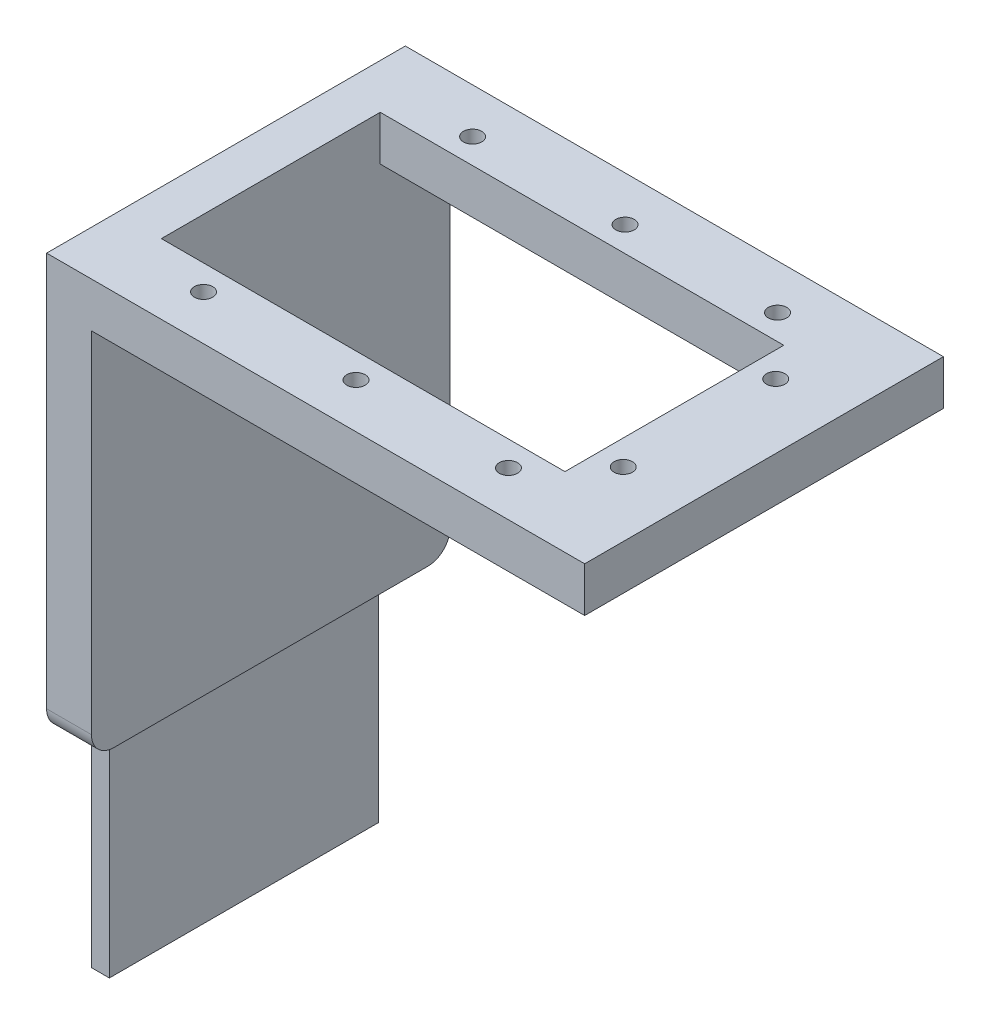
ISO-10303-21;
HEADER;
FILE_DESCRIPTION(('STEP AP214'),'2;1');
FILE_NAME('part.step','',(''),(''),'','','');
FILE_SCHEMA(('AUTOMOTIVE_DESIGN { 1 0 10303 214 1 1 1 1 }'));
ENDSEC;
DATA;
#1=APPLICATION_CONTEXT('core data for automotive mechanical design processes');
#2=APPLICATION_PROTOCOL_DEFINITION('international standard','automotive_design',2000,#1);
#3=PRODUCT_CONTEXT('',#1,'mechanical');
#4=PRODUCT('Part','Part','',(#3));
#5=PRODUCT_RELATED_PRODUCT_CATEGORY('part','',(#4));
#6=PRODUCT_DEFINITION_FORMATION('','',#4);
#7=PRODUCT_DEFINITION_CONTEXT('part definition',#1,'design');
#8=PRODUCT_DEFINITION('design','',#6,#7);
#9=PRODUCT_DEFINITION_SHAPE('','',#8);
#10=(LENGTH_UNIT() NAMED_UNIT(*) SI_UNIT(.MILLI.,.METRE.));
#11=(NAMED_UNIT(*) PLANE_ANGLE_UNIT() SI_UNIT($,.RADIAN.));
#12=(NAMED_UNIT(*) SI_UNIT($,.STERADIAN.) SOLID_ANGLE_UNIT());
#13=UNCERTAINTY_MEASURE_WITH_UNIT(LENGTH_MEASURE(1.E-05),#10,'distance_accuracy_value','');
#14=(GEOMETRIC_REPRESENTATION_CONTEXT(3) GLOBAL_UNCERTAINTY_ASSIGNED_CONTEXT((#13)) GLOBAL_UNIT_ASSIGNED_CONTEXT((#10,
#11,#12)) REPRESENTATION_CONTEXT('',''));
#15=CARTESIAN_POINT('',(0.,0.,0.));
#16=DIRECTION('',(0.,0.,1.));
#17=DIRECTION('',(1.,0.,0.));
#18=AXIS2_PLACEMENT_3D('',#15,#16,#17);
#19=CARTESIAN_POINT('',(0.,-41.5,0.));
#20=DIRECTION('',(0.,1.,0.));
#21=DIRECTION('',(0.,0.,1.));
#22=AXIS2_PLACEMENT_3D('',#19,#20,#21);
#23=PLANE('',#22);
#24=DIRECTION('',(-1.,0.,0.));
#25=VECTOR('',#24,1.);
#26=CARTESIAN_POINT('',(0.,-41.5,-2.5));
#27=LINE('',#26,#25);
#28=CARTESIAN_POINT('',(5.,-41.5,-2.5));
#29=VERTEX_POINT('',#28);
#30=CARTESIAN_POINT('',(4.50000000000001,-41.5,-2.5));
#31=VERTEX_POINT('',#30);
#32=EDGE_CURVE('E265',#29,#31,#27,.T.);
#33=ORIENTED_EDGE('',*,*,#32,.T.);
#34=DIRECTION('',(0.,0.,1.));
#35=VECTOR('',#34,1.);
#36=CARTESIAN_POINT('',(4.50000000000001,-41.5,-35.));
#37=LINE('',#36,#35);
#38=CARTESIAN_POINT('',(4.50000000000001,-41.5,-37.5));
#39=VERTEX_POINT('',#38);
#40=EDGE_CURVE('E259',#31,#39,#37,.F.);
#41=ORIENTED_EDGE('',*,*,#40,.T.);
#42=DIRECTION('',(1.,0.,0.));
#43=VECTOR('',#42,1.);
#44=CARTESIAN_POINT('',(0.,-41.5,-37.5));
#45=LINE('',#44,#43);
#46=CARTESIAN_POINT('',(5.,-41.5,-37.5));
#47=VERTEX_POINT('',#46);
#48=EDGE_CURVE('E263',#39,#47,#45,.T.);
#49=ORIENTED_EDGE('',*,*,#48,.T.);
#50=DIRECTION('',(0.,0.,1.));
#51=VECTOR('',#50,1.);
#52=CARTESIAN_POINT('',(5.,-41.5,-40.));
#53=LINE('',#52,#51);
#54=EDGE_CURVE('E191',#47,#29,#53,.T.);
#55=ORIENTED_EDGE('',*,*,#54,.T.);
#56=EDGE_LOOP('',(#33,#41,#49,#55));
#57=FACE_BOUND('',#56,.T.);
#58=ADVANCED_FACE('F39',(#57),#23,.F.);
#59=CARTESIAN_POINT('',(0.,5.,0.));
#60=DIRECTION('',(0.,-1.,0.));
#61=DIRECTION('',(0.,0.,-1.));
#62=AXIS2_PLACEMENT_3D('',#59,#60,#61);
#63=PLANE('',#62);
#64=CARTESIAN_POINT('',(29.5000000000001,5.,-5.00000000000046));
#65=DIRECTION('',(0.,-1.,0.));
#66=DIRECTION('',(0.,0.,-1.));
#67=AXIS2_PLACEMENT_3D('',#64,#65,#66);
#68=CIRCLE('',#67,1.025);
#69=CARTESIAN_POINT('',(29.5000000000001,5.,-6.02500000000046));
#70=VERTEX_POINT('',#69);
#71=EDGE_CURVE('E301',#70,#70,#68,.F.);
#72=ORIENTED_EDGE('',*,*,#71,.F.);
#73=EDGE_LOOP('',(#72));
#74=FACE_BOUND('',#73,.T.);
#75=CARTESIAN_POINT('',(12.5000000000001,5.,-5.00000000000046));
#76=DIRECTION('',(0.,-1.,0.));
#77=DIRECTION('',(0.,0.,-1.));
#78=AXIS2_PLACEMENT_3D('',#75,#76,#77);
#79=CIRCLE('',#78,1.025);
#80=CARTESIAN_POINT('',(12.5000000000001,5.,-6.02500000000046));
#81=VERTEX_POINT('',#80);
#82=EDGE_CURVE('E616',#81,#81,#79,.F.);
#83=ORIENTED_EDGE('',*,*,#82,.F.);
#84=EDGE_LOOP('',(#83));
#85=FACE_BOUND('',#84,.T.);
#86=CARTESIAN_POINT('',(52.8000000000001,5.,-11.5000000000005));
#87=DIRECTION('',(0.,-1.,0.));
#88=DIRECTION('',(0.,0.,-1.));
#89=AXIS2_PLACEMENT_3D('',#86,#87,#88);
#90=CIRCLE('',#89,1.025);
#91=CARTESIAN_POINT('',(52.8000000000001,5.,-12.5250000000005));
#92=VERTEX_POINT('',#91);
#93=EDGE_CURVE('E621',#92,#92,#90,.F.);
#94=ORIENTED_EDGE('',*,*,#93,.F.);
#95=EDGE_LOOP('',(#94));
#96=FACE_BOUND('',#95,.T.);
#97=CARTESIAN_POINT('',(12.5000000000001,5.,-34.9999999999993));
#98=DIRECTION('',(0.,-1.,0.));
#99=DIRECTION('',(0.,0.,-1.));
#100=AXIS2_PLACEMENT_3D('',#97,#98,#99);
#101=CIRCLE('',#100,1.025);
#102=CARTESIAN_POINT('',(12.5000000000001,5.,-36.0249999999993));
#103=VERTEX_POINT('',#102);
#104=EDGE_CURVE('E625',#103,#103,#101,.F.);
#105=ORIENTED_EDGE('',*,*,#104,.F.);
#106=EDGE_LOOP('',(#105));
#107=FACE_BOUND('',#106,.T.);
#108=CARTESIAN_POINT('',(29.5000000000001,5.,-34.9999999999993));
#109=DIRECTION('',(0.,-1.,0.));
#110=DIRECTION('',(0.,0.,-1.));
#111=AXIS2_PLACEMENT_3D('',#108,#109,#110);
#112=CIRCLE('',#111,1.025);
#113=CARTESIAN_POINT('',(29.5000000000001,5.,-36.0249999999993));
#114=VERTEX_POINT('',#113);
#115=EDGE_CURVE('E628',#114,#114,#112,.F.);
#116=ORIENTED_EDGE('',*,*,#115,.F.);
#117=EDGE_LOOP('',(#116));
#118=FACE_BOUND('',#117,.T.);
#119=CARTESIAN_POINT('',(46.5000000000001,5.,-34.9999999999993));
#120=DIRECTION('',(0.,-1.,0.));
#121=DIRECTION('',(0.,0.,-1.));
#122=AXIS2_PLACEMENT_3D('',#119,#120,#121);
#123=CIRCLE('',#122,1.025);
#124=CARTESIAN_POINT('',(46.5000000000001,5.,-36.0249999999993));
#125=VERTEX_POINT('',#124);
#126=EDGE_CURVE('E640',#125,#125,#123,.F.);
#127=ORIENTED_EDGE('',*,*,#126,.F.);
#128=EDGE_LOOP('',(#127));
#129=FACE_BOUND('',#128,.T.);
#130=CARTESIAN_POINT('',(52.8000000000001,5.,-28.4999999999993));
#131=DIRECTION('',(0.,-1.,0.));
#132=DIRECTION('',(0.,0.,-1.));
#133=AXIS2_PLACEMENT_3D('',#130,#131,#132);
#134=CIRCLE('',#133,1.025);
#135=CARTESIAN_POINT('',(52.8000000000001,5.,-29.5249999999993));
#136=VERTEX_POINT('',#135);
#137=EDGE_CURVE('E644',#136,#136,#134,.F.);
#138=ORIENTED_EDGE('',*,*,#137,.F.);
#139=EDGE_LOOP('',(#138));
#140=FACE_BOUND('',#139,.T.);
#141=CARTESIAN_POINT('',(46.5000000000001,5.,-5.00000000000046));
#142=DIRECTION('',(0.,-1.,0.));
#143=DIRECTION('',(0.,0.,-1.));
#144=AXIS2_PLACEMENT_3D('',#141,#142,#143);
#145=CIRCLE('',#144,1.025);
#146=CARTESIAN_POINT('',(46.5000000000001,5.,-6.02500000000045));
#147=VERTEX_POINT('',#146);
#148=EDGE_CURVE('E291',#147,#147,#145,.F.);
#149=ORIENTED_EDGE('',*,*,#148,.F.);
#150=EDGE_LOOP('',(#149));
#151=FACE_BOUND('',#150,.T.);
#152=DIRECTION('',(0.,0.,1.));
#153=VECTOR('',#152,1.);
#154=CARTESIAN_POINT('',(0.,5.,0.));
#155=LINE('',#154,#153);
#156=CARTESIAN_POINT('',(0.,5.,-40.));
#157=VERTEX_POINT('',#156);
#158=CARTESIAN_POINT('',(0.,5.,0.));
#159=VERTEX_POINT('',#158);
#160=EDGE_CURVE('E232',#157,#159,#155,.T.);
#161=ORIENTED_EDGE('',*,*,#160,.T.);
#162=DIRECTION('',(1.,0.,0.));
#163=VECTOR('',#162,1.);
#164=CARTESIAN_POINT('',(0.,5.,0.));
#165=LINE('',#164,#163);
#166=CARTESIAN_POINT('',(60.,5.,0.));
#167=VERTEX_POINT('',#166);
#168=EDGE_CURVE('E235',#159,#167,#165,.T.);
#169=ORIENTED_EDGE('',*,*,#168,.T.);
#170=DIRECTION('',(0.,0.,-1.));
#171=VECTOR('',#170,1.);
#172=CARTESIAN_POINT('',(60.,5.,0.));
#173=LINE('',#172,#171);
#174=CARTESIAN_POINT('',(60.,5.,-40.));
#175=VERTEX_POINT('',#174);
#176=EDGE_CURVE('E238',#167,#175,#173,.T.);
#177=ORIENTED_EDGE('',*,*,#176,.T.);
#178=DIRECTION('',(-1.,0.,0.));
#179=VECTOR('',#178,1.);
#180=CARTESIAN_POINT('',(0.,5.,-40.));
#181=LINE('',#180,#179);
#182=EDGE_CURVE('E240',#175,#157,#181,.T.);
#183=ORIENTED_EDGE('',*,*,#182,.T.);
#184=EDGE_LOOP('',(#161,#169,#177,#183));
#185=FACE_BOUND('',#184,.T.);
#186=DIRECTION('',(0.,0.,1.));
#187=VECTOR('',#186,1.);
#188=CARTESIAN_POINT('',(5.,5.,-7.8));
#189=LINE('',#188,#187);
#190=CARTESIAN_POINT('',(5.,5.,-32.2));
#191=VERTEX_POINT('',#190);
#192=CARTESIAN_POINT('',(5.,5.,-7.8));
#193=VERTEX_POINT('',#192);
#194=EDGE_CURVE('E205',#191,#193,#189,.T.);
#195=ORIENTED_EDGE('',*,*,#194,.F.);
#196=DIRECTION('',(-1.,0.,0.));
#197=VECTOR('',#196,1.);
#198=CARTESIAN_POINT('',(5.,5.,-32.2));
#199=LINE('',#198,#197);
#200=CARTESIAN_POINT('',(50.,5.,-32.2));
#201=VERTEX_POINT('',#200);
#202=EDGE_CURVE('E213',#201,#191,#199,.T.);
#203=ORIENTED_EDGE('',*,*,#202,.F.);
#204=DIRECTION('',(0.,0.,-1.));
#205=VECTOR('',#204,1.);
#206=CARTESIAN_POINT('',(50.,5.,-7.8));
#207=LINE('',#206,#205);
#208=CARTESIAN_POINT('',(50.,5.,-7.8));
#209=VERTEX_POINT('',#208);
#210=EDGE_CURVE('E210',#209,#201,#207,.T.);
#211=ORIENTED_EDGE('',*,*,#210,.F.);
#212=DIRECTION('',(1.,0.,0.));
#213=VECTOR('',#212,1.);
#214=CARTESIAN_POINT('',(5.,5.,-7.8));
#215=LINE('',#214,#213);
#216=EDGE_CURVE('E207',#193,#209,#215,.T.);
#217=ORIENTED_EDGE('',*,*,#216,.F.);
#218=EDGE_LOOP('',(#195,#203,#211,#217));
#219=FACE_BOUND('',#218,.T.);
#220=ADVANCED_FACE('F337',(#74,#85,#96,#107,#118,#129,#140,#151,#185,#219),#63,.F.);
#221=CARTESIAN_POINT('',(0.,0.,0.));
#222=DIRECTION('',(0.,-1.,0.));
#223=DIRECTION('',(0.,0.,-1.));
#224=AXIS2_PLACEMENT_3D('',#221,#222,#223);
#225=PLANE('',#224);
#226=CARTESIAN_POINT('',(29.5000000000001,0.,-5.00000000000046));
#227=DIRECTION('',(0.,-1.,0.));
#228=DIRECTION('',(0.,0.,-1.));
#229=AXIS2_PLACEMENT_3D('',#226,#227,#228);
#230=CIRCLE('',#229,1.025);
#231=CARTESIAN_POINT('',(29.5000000000001,0.,-6.02500000000046));
#232=VERTEX_POINT('',#231);
#233=EDGE_CURVE('E403',#232,#232,#230,.T.);
#234=ORIENTED_EDGE('',*,*,#233,.F.);
#235=EDGE_LOOP('',(#234));
#236=FACE_BOUND('',#235,.T.);
#237=CARTESIAN_POINT('',(12.5000000000001,0.,-5.00000000000046));
#238=DIRECTION('',(0.,-1.,0.));
#239=DIRECTION('',(0.,0.,-1.));
#240=AXIS2_PLACEMENT_3D('',#237,#238,#239);
#241=CIRCLE('',#240,1.025);
#242=CARTESIAN_POINT('',(12.5000000000001,0.,-6.02500000000046));
#243=VERTEX_POINT('',#242);
#244=EDGE_CURVE('E407',#243,#243,#241,.T.);
#245=ORIENTED_EDGE('',*,*,#244,.F.);
#246=EDGE_LOOP('',(#245));
#247=FACE_BOUND('',#246,.T.);
#248=CARTESIAN_POINT('',(52.8000000000001,0.,-11.5000000000005));
#249=DIRECTION('',(0.,-1.,0.));
#250=DIRECTION('',(0.,0.,-1.));
#251=AXIS2_PLACEMENT_3D('',#248,#249,#250);
#252=CIRCLE('',#251,1.025);
#253=CARTESIAN_POINT('',(52.8000000000001,0.,-12.5250000000005));
#254=VERTEX_POINT('',#253);
#255=EDGE_CURVE('E411',#254,#254,#252,.T.);
#256=ORIENTED_EDGE('',*,*,#255,.F.);
#257=EDGE_LOOP('',(#256));
#258=FACE_BOUND('',#257,.T.);
#259=CARTESIAN_POINT('',(12.5000000000001,0.,-34.9999999999993));
#260=DIRECTION('',(0.,-1.,0.));
#261=DIRECTION('',(0.,0.,1.));
#262=AXIS2_PLACEMENT_3D('',#259,#260,#261);
#263=CIRCLE('',#262,1.025);
#264=CARTESIAN_POINT('',(12.5000000000001,0.,-33.9749999999993));
#265=VERTEX_POINT('',#264);
#266=EDGE_CURVE('E415',#265,#265,#263,.T.);
#267=ORIENTED_EDGE('',*,*,#266,.F.);
#268=EDGE_LOOP('',(#267));
#269=FACE_BOUND('',#268,.T.);
#270=CARTESIAN_POINT('',(29.5000000000001,0.,-34.9999999999993));
#271=DIRECTION('',(0.,-1.,0.));
#272=DIRECTION('',(0.,0.,1.));
#273=AXIS2_PLACEMENT_3D('',#270,#271,#272);
#274=CIRCLE('',#273,1.025);
#275=CARTESIAN_POINT('',(29.5000000000001,0.,-33.9749999999993));
#276=VERTEX_POINT('',#275);
#277=EDGE_CURVE('E419',#276,#276,#274,.T.);
#278=ORIENTED_EDGE('',*,*,#277,.F.);
#279=EDGE_LOOP('',(#278));
#280=FACE_BOUND('',#279,.T.);
#281=CARTESIAN_POINT('',(46.5000000000001,0.,-34.9999999999993));
#282=DIRECTION('',(0.,-1.,0.));
#283=DIRECTION('',(0.,0.,1.));
#284=AXIS2_PLACEMENT_3D('',#281,#282,#283);
#285=CIRCLE('',#284,1.025);
#286=CARTESIAN_POINT('',(46.5000000000001,0.,-33.9749999999993));
#287=VERTEX_POINT('',#286);
#288=EDGE_CURVE('E423',#287,#287,#285,.T.);
#289=ORIENTED_EDGE('',*,*,#288,.F.);
#290=EDGE_LOOP('',(#289));
#291=FACE_BOUND('',#290,.T.);
#292=CARTESIAN_POINT('',(52.8000000000001,0.,-28.4999999999993));
#293=DIRECTION('',(0.,-1.,0.));
#294=DIRECTION('',(0.,0.,1.));
#295=AXIS2_PLACEMENT_3D('',#292,#293,#294);
#296=CIRCLE('',#295,1.025);
#297=CARTESIAN_POINT('',(52.8000000000001,0.,-27.4749999999993));
#298=VERTEX_POINT('',#297);
#299=EDGE_CURVE('E427',#298,#298,#296,.T.);
#300=ORIENTED_EDGE('',*,*,#299,.F.);
#301=EDGE_LOOP('',(#300));
#302=FACE_BOUND('',#301,.T.);
#303=CARTESIAN_POINT('',(46.5000000000001,0.,-5.00000000000046));
#304=DIRECTION('',(0.,-1.,0.));
#305=DIRECTION('',(0.,0.,-1.));
#306=AXIS2_PLACEMENT_3D('',#303,#304,#305);
#307=CIRCLE('',#306,1.025);
#308=CARTESIAN_POINT('',(46.5000000000001,0.,-6.02500000000045));
#309=VERTEX_POINT('',#308);
#310=EDGE_CURVE('E296',#309,#309,#307,.T.);
#311=ORIENTED_EDGE('',*,*,#310,.F.);
#312=EDGE_LOOP('',(#311));
#313=FACE_BOUND('',#312,.T.);
#314=DIRECTION('',(0.,0.,1.));
#315=VECTOR('',#314,1.);
#316=CARTESIAN_POINT('',(5.,0.,-40.));
#317=LINE('',#316,#315);
#318=CARTESIAN_POINT('',(5.,0.,-40.));
#319=VERTEX_POINT('',#318);
#320=CARTESIAN_POINT('',(5.,0.,-32.2));
#321=VERTEX_POINT('',#320);
#322=EDGE_CURVE('E188',#319,#321,#317,.T.);
#323=ORIENTED_EDGE('',*,*,#322,.F.);
#324=DIRECTION('',(-1.,0.,0.));
#325=VECTOR('',#324,1.);
#326=CARTESIAN_POINT('',(0.,0.,-40.));
#327=LINE('',#326,#325);
#328=CARTESIAN_POINT('',(60.,0.,-40.));
#329=VERTEX_POINT('',#328);
#330=EDGE_CURVE('E236',#329,#319,#327,.T.);
#331=ORIENTED_EDGE('',*,*,#330,.F.);
#332=DIRECTION('',(0.,0.,-1.));
#333=VECTOR('',#332,1.);
#334=CARTESIAN_POINT('',(60.,0.,0.));
#335=LINE('',#334,#333);
#336=CARTESIAN_POINT('',(60.,0.,0.));
#337=VERTEX_POINT('',#336);
#338=EDGE_CURVE('E244',#337,#329,#335,.T.);
#339=ORIENTED_EDGE('',*,*,#338,.F.);
#340=DIRECTION('',(1.,0.,0.));
#341=VECTOR('',#340,1.);
#342=CARTESIAN_POINT('',(0.,0.,0.));
#343=LINE('',#342,#341);
#344=CARTESIAN_POINT('',(5.,0.,0.));
#345=VERTEX_POINT('',#344);
#346=EDGE_CURVE('E231',#345,#337,#343,.T.);
#347=ORIENTED_EDGE('',*,*,#346,.F.);
#348=CARTESIAN_POINT('',(5.,0.,-7.8));
#349=VERTEX_POINT('',#348);
#350=EDGE_CURVE('E193',#349,#345,#317,.T.);
#351=ORIENTED_EDGE('',*,*,#350,.F.);
#352=DIRECTION('',(1.,0.,0.));
#353=VECTOR('',#352,1.);
#354=CARTESIAN_POINT('',(5.,0.,-7.8));
#355=LINE('',#354,#353);
#356=CARTESIAN_POINT('',(50.,0.,-7.8));
#357=VERTEX_POINT('',#356);
#358=EDGE_CURVE('E204',#349,#357,#355,.T.);
#359=ORIENTED_EDGE('',*,*,#358,.T.);
#360=DIRECTION('',(0.,0.,-1.));
#361=VECTOR('',#360,1.);
#362=CARTESIAN_POINT('',(50.,0.,-7.8));
#363=LINE('',#362,#361);
#364=CARTESIAN_POINT('',(50.,0.,-32.2));
#365=VERTEX_POINT('',#364);
#366=EDGE_CURVE('E218',#357,#365,#363,.T.);
#367=ORIENTED_EDGE('',*,*,#366,.T.);
#368=DIRECTION('',(-1.,0.,0.));
#369=VECTOR('',#368,1.);
#370=CARTESIAN_POINT('',(5.,0.,-32.2));
#371=LINE('',#370,#369);
#372=EDGE_CURVE('E208',#365,#321,#371,.T.);
#373=ORIENTED_EDGE('',*,*,#372,.T.);
#374=EDGE_LOOP('',(#323,#331,#339,#347,#351,#359,#367,#373));
#375=FACE_BOUND('',#374,.T.);
#376=ADVANCED_FACE('F347',(#236,#247,#258,#269,#280,#291,#302,#313,#375),#225,.T.);
#377=CARTESIAN_POINT('',(0.,5.,0.));
#378=DIRECTION('',(1.,0.,0.));
#379=DIRECTION('',(0.,0.,-1.));
#380=AXIS2_PLACEMENT_3D('',#377,#378,#379);
#381=PLANE('',#380);
#382=DIRECTION('',(0.,1.,0.));
#383=VECTOR('',#382,1.);
#384=CARTESIAN_POINT('',(0.,-66.5,-5.));
#385=LINE('',#384,#383);
#386=CARTESIAN_POINT('',(0.,-66.5,-5.));
#387=VERTEX_POINT('',#386);
#388=CARTESIAN_POINT('',(0.,-44.,-5.));
#389=VERTEX_POINT('',#388);
#390=EDGE_CURVE('E169',#387,#389,#385,.T.);
#391=ORIENTED_EDGE('',*,*,#390,.T.);
#392=CARTESIAN_POINT('',(0.,-44.,-2.5));
#393=DIRECTION('',(1.,0.,0.));
#394=DIRECTION('',(0.,0.,-1.));
#395=AXIS2_PLACEMENT_3D('',#392,#393,#394);
#396=CIRCLE('',#395,2.5);
#397=CARTESIAN_POINT('',(0.,-41.5,-2.5));
#398=VERTEX_POINT('',#397);
#399=EDGE_CURVE('E281',#389,#398,#396,.T.);
#400=ORIENTED_EDGE('',*,*,#399,.T.);
#401=CARTESIAN_POINT('',(0.,-39.,-2.5));
#402=DIRECTION('',(1.,0.,0.));
#403=DIRECTION('',(0.,0.,-1.));
#404=AXIS2_PLACEMENT_3D('',#401,#402,#403);
#405=CIRCLE('',#404,2.5);
#406=CARTESIAN_POINT('',(0.,-39.,0.));
#407=VERTEX_POINT('',#406);
#408=EDGE_CURVE('E273',#398,#407,#405,.F.);
#409=ORIENTED_EDGE('',*,*,#408,.T.);
#410=DIRECTION('',(0.,-1.,0.));
#411=VECTOR('',#410,1.);
#412=CARTESIAN_POINT('',(0.,5.,0.));
#413=LINE('',#412,#411);
#414=EDGE_CURVE('E256',#159,#407,#413,.T.);
#415=ORIENTED_EDGE('',*,*,#414,.F.);
#416=ORIENTED_EDGE('',*,*,#160,.F.);
#417=DIRECTION('',(0.,-1.,0.));
#418=VECTOR('',#417,1.);
#419=CARTESIAN_POINT('',(0.,5.,-40.));
#420=LINE('',#419,#418);
#421=CARTESIAN_POINT('',(0.,-39.,-40.));
#422=VERTEX_POINT('',#421);
#423=EDGE_CURVE('E242',#157,#422,#420,.T.);
#424=ORIENTED_EDGE('',*,*,#423,.T.);
#425=CARTESIAN_POINT('',(0.,-39.,-37.5));
#426=DIRECTION('',(1.,0.,0.));
#427=DIRECTION('',(0.,0.,-1.));
#428=AXIS2_PLACEMENT_3D('',#425,#426,#427);
#429=CIRCLE('',#428,2.5);
#430=CARTESIAN_POINT('',(0.,-41.5,-37.5));
#431=VERTEX_POINT('',#430);
#432=EDGE_CURVE('E271',#422,#431,#429,.F.);
#433=ORIENTED_EDGE('',*,*,#432,.T.);
#434=CARTESIAN_POINT('',(0.,-44.,-37.5));
#435=DIRECTION('',(1.,0.,0.));
#436=DIRECTION('',(0.,0.,-1.));
#437=AXIS2_PLACEMENT_3D('',#434,#435,#436);
#438=CIRCLE('',#437,2.5);
#439=CARTESIAN_POINT('',(0.,-44.,-35.));
#440=VERTEX_POINT('',#439);
#441=EDGE_CURVE('E11',#431,#440,#438,.T.);
#442=ORIENTED_EDGE('',*,*,#441,.T.);
#443=DIRECTION('',(0.,1.,0.));
#444=VECTOR('',#443,1.);
#445=CARTESIAN_POINT('',(0.,-66.5,-35.));
#446=LINE('',#445,#444);
#447=CARTESIAN_POINT('',(0.,-66.5,-35.));
#448=VERTEX_POINT('',#447);
#449=EDGE_CURVE('E194',#448,#440,#446,.T.);
#450=ORIENTED_EDGE('',*,*,#449,.F.);
#451=DIRECTION('',(0.,0.,-1.));
#452=VECTOR('',#451,1.);
#453=CARTESIAN_POINT('',(0.,-66.5,-35.));
#454=LINE('',#453,#452);
#455=EDGE_CURVE('E172',#387,#448,#454,.T.);
#456=ORIENTED_EDGE('',*,*,#455,.F.);
#457=EDGE_LOOP('',(#391,#400,#409,#415,#416,#424,#433,#442,#450,#456));
#458=FACE_BOUND('',#457,.T.);
#459=ADVANCED_FACE('F330',(#458),#381,.F.);
#460=CARTESIAN_POINT('',(0.,5.,0.));
#461=DIRECTION('',(0.,0.,-1.));
#462=DIRECTION('',(-1.,0.,0.));
#463=AXIS2_PLACEMENT_3D('',#460,#461,#462);
#464=PLANE('',#463);
#465=ORIENTED_EDGE('',*,*,#414,.T.);
#466=DIRECTION('',(-1.,0.,0.));
#467=VECTOR('',#466,1.);
#468=CARTESIAN_POINT('',(0.,-39.,0.));
#469=LINE('',#468,#467);
#470=CARTESIAN_POINT('',(5.,-39.,0.));
#471=VERTEX_POINT('',#470);
#472=EDGE_CURVE('E64',#407,#471,#469,.F.);
#473=ORIENTED_EDGE('',*,*,#472,.T.);
#474=DIRECTION('',(0.,1.,0.));
#475=VECTOR('',#474,1.);
#476=CARTESIAN_POINT('',(5.,-41.5,0.));
#477=LINE('',#476,#475);
#478=EDGE_CURVE('E199',#471,#345,#477,.T.);
#479=ORIENTED_EDGE('',*,*,#478,.T.);
#480=ORIENTED_EDGE('',*,*,#346,.T.);
#481=DIRECTION('',(0.,-1.,0.));
#482=VECTOR('',#481,1.);
#483=CARTESIAN_POINT('',(60.,5.,0.));
#484=LINE('',#483,#482);
#485=EDGE_CURVE('E253',#167,#337,#484,.T.);
#486=ORIENTED_EDGE('',*,*,#485,.F.);
#487=ORIENTED_EDGE('',*,*,#168,.F.);
#488=EDGE_LOOP('',(#465,#473,#479,#480,#486,#487));
#489=FACE_BOUND('',#488,.T.);
#490=ADVANCED_FACE('F333',(#489),#464,.F.);
#491=CARTESIAN_POINT('',(60.,5.,0.));
#492=DIRECTION('',(-1.,0.,0.));
#493=DIRECTION('',(0.,0.,1.));
#494=AXIS2_PLACEMENT_3D('',#491,#492,#493);
#495=PLANE('',#494);
#496=ORIENTED_EDGE('',*,*,#338,.T.);
#497=DIRECTION('',(0.,-1.,0.));
#498=VECTOR('',#497,1.);
#499=CARTESIAN_POINT('',(60.,5.,-40.));
#500=LINE('',#499,#498);
#501=EDGE_CURVE('E250',#175,#329,#500,.T.);
#502=ORIENTED_EDGE('',*,*,#501,.F.);
#503=ORIENTED_EDGE('',*,*,#176,.F.);
#504=ORIENTED_EDGE('',*,*,#485,.T.);
#505=EDGE_LOOP('',(#496,#502,#503,#504));
#506=FACE_BOUND('',#505,.T.);
#507=ADVANCED_FACE('F366',(#506),#495,.F.);
#508=CARTESIAN_POINT('',(0.,5.,-40.));
#509=DIRECTION('',(0.,0.,1.));
#510=DIRECTION('',(1.,0.,0.));
#511=AXIS2_PLACEMENT_3D('',#508,#509,#510);
#512=PLANE('',#511);
#513=DIRECTION('',(0.,1.,0.));
#514=VECTOR('',#513,1.);
#515=CARTESIAN_POINT('',(5.,-41.5,-40.));
#516=LINE('',#515,#514);
#517=CARTESIAN_POINT('',(5.,-39.,-40.));
#518=VERTEX_POINT('',#517);
#519=EDGE_CURVE('E202',#518,#319,#516,.T.);
#520=ORIENTED_EDGE('',*,*,#519,.F.);
#521=DIRECTION('',(1.,0.,0.));
#522=VECTOR('',#521,1.);
#523=CARTESIAN_POINT('',(0.,-39.,-40.));
#524=LINE('',#523,#522);
#525=EDGE_CURVE('E279',#518,#422,#524,.F.);
#526=ORIENTED_EDGE('',*,*,#525,.T.);
#527=ORIENTED_EDGE('',*,*,#423,.F.);
#528=ORIENTED_EDGE('',*,*,#182,.F.);
#529=ORIENTED_EDGE('',*,*,#501,.T.);
#530=ORIENTED_EDGE('',*,*,#330,.T.);
#531=EDGE_LOOP('',(#520,#526,#527,#528,#529,#530));
#532=FACE_BOUND('',#531,.T.);
#533=ADVANCED_FACE('F342',(#532),#512,.F.);
#534=CARTESIAN_POINT('',(5.,5.,-7.8));
#535=DIRECTION('',(1.,0.,0.));
#536=DIRECTION('',(0.,0.,-1.));
#537=AXIS2_PLACEMENT_3D('',#534,#535,#536);
#538=PLANE('',#537);
#539=ORIENTED_EDGE('',*,*,#478,.F.);
#540=CARTESIAN_POINT('',(5.,-39.,-2.5));
#541=DIRECTION('',(1.,0.,0.));
#542=DIRECTION('',(0.,0.,-1.));
#543=AXIS2_PLACEMENT_3D('',#540,#541,#542);
#544=CIRCLE('',#543,2.5);
#545=EDGE_CURVE('E277',#471,#29,#544,.T.);
#546=ORIENTED_EDGE('',*,*,#545,.T.);
#547=ORIENTED_EDGE('',*,*,#54,.F.);
#548=CARTESIAN_POINT('',(5.,-39.,-37.5));
#549=DIRECTION('',(1.,0.,0.));
#550=DIRECTION('',(0.,0.,-1.));
#551=AXIS2_PLACEMENT_3D('',#548,#549,#550);
#552=CIRCLE('',#551,2.5);
#553=EDGE_CURVE('E56',#47,#518,#552,.T.);
#554=ORIENTED_EDGE('',*,*,#553,.T.);
#555=ORIENTED_EDGE('',*,*,#519,.T.);
#556=ORIENTED_EDGE('',*,*,#322,.T.);
#557=DIRECTION('',(0.,-1.,0.));
#558=VECTOR('',#557,1.);
#559=CARTESIAN_POINT('',(5.,5.,-32.2));
#560=LINE('',#559,#558);
#561=EDGE_CURVE('E215',#191,#321,#560,.T.);
#562=ORIENTED_EDGE('',*,*,#561,.F.);
#563=ORIENTED_EDGE('',*,*,#194,.T.);
#564=DIRECTION('',(0.,-1.,0.));
#565=VECTOR('',#564,1.);
#566=CARTESIAN_POINT('',(5.,5.,-7.8));
#567=LINE('',#566,#565);
#568=EDGE_CURVE('E228',#193,#349,#567,.T.);
#569=ORIENTED_EDGE('',*,*,#568,.T.);
#570=ORIENTED_EDGE('',*,*,#350,.T.);
#571=EDGE_LOOP('',(#539,#546,#547,#554,#555,#556,#562,#563,#569,#570));
#572=FACE_BOUND('',#571,.T.);
#573=ADVANCED_FACE('F323',(#572),#538,.T.);
#574=CARTESIAN_POINT('',(5.,5.,-7.8));
#575=DIRECTION('',(0.,0.,-1.));
#576=DIRECTION('',(-1.,0.,0.));
#577=AXIS2_PLACEMENT_3D('',#574,#575,#576);
#578=PLANE('',#577);
#579=ORIENTED_EDGE('',*,*,#358,.F.);
#580=ORIENTED_EDGE('',*,*,#568,.F.);
#581=ORIENTED_EDGE('',*,*,#216,.T.);
#582=DIRECTION('',(0.,-1.,0.));
#583=VECTOR('',#582,1.);
#584=CARTESIAN_POINT('',(50.,5.,-7.8));
#585=LINE('',#584,#583);
#586=EDGE_CURVE('E226',#209,#357,#585,.T.);
#587=ORIENTED_EDGE('',*,*,#586,.T.);
#588=EDGE_LOOP('',(#579,#580,#581,#587));
#589=FACE_BOUND('',#588,.T.);
#590=ADVANCED_FACE('F361',(#589),#578,.T.);
#591=CARTESIAN_POINT('',(50.,5.,-7.8));
#592=DIRECTION('',(-1.,0.,0.));
#593=DIRECTION('',(0.,0.,1.));
#594=AXIS2_PLACEMENT_3D('',#591,#592,#593);
#595=PLANE('',#594);
#596=ORIENTED_EDGE('',*,*,#366,.F.);
#597=ORIENTED_EDGE('',*,*,#586,.F.);
#598=ORIENTED_EDGE('',*,*,#210,.T.);
#599=DIRECTION('',(0.,-1.,0.));
#600=VECTOR('',#599,1.);
#601=CARTESIAN_POINT('',(50.,5.,-32.2));
#602=LINE('',#601,#600);
#603=EDGE_CURVE('E224',#201,#365,#602,.T.);
#604=ORIENTED_EDGE('',*,*,#603,.T.);
#605=EDGE_LOOP('',(#596,#597,#598,#604));
#606=FACE_BOUND('',#605,.T.);
#607=ADVANCED_FACE('F363',(#606),#595,.T.);
#608=CARTESIAN_POINT('',(5.,5.,-32.2));
#609=DIRECTION('',(0.,0.,1.));
#610=DIRECTION('',(1.,0.,0.));
#611=AXIS2_PLACEMENT_3D('',#608,#609,#610);
#612=PLANE('',#611);
#613=ORIENTED_EDGE('',*,*,#372,.F.);
#614=ORIENTED_EDGE('',*,*,#603,.F.);
#615=ORIENTED_EDGE('',*,*,#202,.T.);
#616=ORIENTED_EDGE('',*,*,#561,.T.);
#617=EDGE_LOOP('',(#613,#614,#615,#616));
#618=FACE_BOUND('',#617,.T.);
#619=ADVANCED_FACE('F352',(#618),#612,.T.);
#620=CARTESIAN_POINT('',(2.00000000000001,-66.5,-35.));
#621=DIRECTION('',(-1.,0.,0.));
#622=DIRECTION('',(0.,0.,1.));
#623=AXIS2_PLACEMENT_3D('',#620,#621,#622);
#624=PLANE('',#623);
#625=DIRECTION('',(0.,1.,0.));
#626=VECTOR('',#625,1.);
#627=CARTESIAN_POINT('',(2.00000000000001,-66.5,-35.));
#628=LINE('',#627,#626);
#629=CARTESIAN_POINT('',(2.00000000000001,-66.5,-35.));
#630=VERTEX_POINT('',#629);
#631=CARTESIAN_POINT('',(2.00000000000001,-44.,-35.));
#632=VERTEX_POINT('',#631);
#633=EDGE_CURVE('E307',#630,#632,#628,.T.);
#634=ORIENTED_EDGE('',*,*,#633,.T.);
#635=DIRECTION('',(0.,0.,1.));
#636=VECTOR('',#635,1.);
#637=CARTESIAN_POINT('',(2.00000000000001,-44.,-5.));
#638=LINE('',#637,#636);
#639=CARTESIAN_POINT('',(2.00000000000001,-44.,-5.));
#640=VERTEX_POINT('',#639);
#641=EDGE_CURVE('E187',#632,#640,#638,.T.);
#642=ORIENTED_EDGE('',*,*,#641,.T.);
#643=DIRECTION('',(0.,1.,0.));
#644=VECTOR('',#643,1.);
#645=CARTESIAN_POINT('',(2.00000000000001,-66.5,-5.));
#646=LINE('',#645,#644);
#647=CARTESIAN_POINT('',(2.00000000000001,-66.5,-5.));
#648=VERTEX_POINT('',#647);
#649=EDGE_CURVE('E166',#648,#640,#646,.T.);
#650=ORIENTED_EDGE('',*,*,#649,.F.);
#651=DIRECTION('',(0.,0.,1.));
#652=VECTOR('',#651,1.);
#653=CARTESIAN_POINT('',(2.00000000000001,-66.5,-35.));
#654=LINE('',#653,#652);
#655=EDGE_CURVE('E173',#630,#648,#654,.T.);
#656=ORIENTED_EDGE('',*,*,#655,.F.);
#657=EDGE_LOOP('',(#634,#642,#650,#656));
#658=FACE_BOUND('',#657,.T.);
#659=ADVANCED_FACE('F185',(#658),#624,.F.);
#660=CARTESIAN_POINT('',(2.00000000000001,-66.5,-5.));
#661=DIRECTION('',(0.,0.,-1.));
#662=DIRECTION('',(-1.,0.,0.));
#663=AXIS2_PLACEMENT_3D('',#660,#661,#662);
#664=PLANE('',#663);
#665=ORIENTED_EDGE('',*,*,#649,.T.);
#666=DIRECTION('',(-1.,0.,0.));
#667=VECTOR('',#666,1.);
#668=CARTESIAN_POINT('',(0.,-44.,-5.));
#669=LINE('',#668,#667);
#670=EDGE_CURVE('E261',#640,#389,#669,.T.);
#671=ORIENTED_EDGE('',*,*,#670,.T.);
#672=ORIENTED_EDGE('',*,*,#390,.F.);
#673=DIRECTION('',(-1.,0.,0.));
#674=VECTOR('',#673,1.);
#675=CARTESIAN_POINT('',(2.00000000000001,-66.5,-5.));
#676=LINE('',#675,#674);
#677=EDGE_CURVE('E161',#648,#387,#676,.T.);
#678=ORIENTED_EDGE('',*,*,#677,.F.);
#679=EDGE_LOOP('',(#665,#671,#672,#678));
#680=FACE_BOUND('',#679,.T.);
#681=ADVANCED_FACE('F163',(#680),#664,.F.);
#682=CARTESIAN_POINT('',(2.00000000000001,-66.5,-35.));
#683=DIRECTION('',(0.,0.,1.));
#684=DIRECTION('',(1.,0.,0.));
#685=AXIS2_PLACEMENT_3D('',#682,#683,#684);
#686=PLANE('',#685);
#687=ORIENTED_EDGE('',*,*,#449,.T.);
#688=DIRECTION('',(1.,0.,0.));
#689=VECTOR('',#688,1.);
#690=CARTESIAN_POINT('',(4.50000000000001,-44.,-35.));
#691=LINE('',#690,#689);
#692=EDGE_CURVE('E268',#440,#632,#691,.T.);
#693=ORIENTED_EDGE('',*,*,#692,.T.);
#694=ORIENTED_EDGE('',*,*,#633,.F.);
#695=DIRECTION('',(1.,0.,0.));
#696=VECTOR('',#695,1.);
#697=CARTESIAN_POINT('',(2.00000000000001,-66.5,-35.));
#698=LINE('',#697,#696);
#699=EDGE_CURVE('E178',#448,#630,#698,.T.);
#700=ORIENTED_EDGE('',*,*,#699,.F.);
#701=EDGE_LOOP('',(#687,#693,#694,#700));
#702=FACE_BOUND('',#701,.T.);
#703=ADVANCED_FACE('F312',(#702),#686,.F.);
#704=CARTESIAN_POINT('',(0.,-66.5,0.));
#705=DIRECTION('',(0.,-1.,0.));
#706=DIRECTION('',(0.,0.,-1.));
#707=AXIS2_PLACEMENT_3D('',#704,#705,#706);
#708=PLANE('',#707);
#709=ORIENTED_EDGE('',*,*,#655,.T.);
#710=ORIENTED_EDGE('',*,*,#677,.T.);
#711=ORIENTED_EDGE('',*,*,#455,.T.);
#712=ORIENTED_EDGE('',*,*,#699,.T.);
#713=EDGE_LOOP('',(#709,#710,#711,#712));
#714=FACE_BOUND('',#713,.T.);
#715=ADVANCED_FACE('F176',(#714),#708,.T.);
#716=CARTESIAN_POINT('',(4.50000000000001,-44.,-35.));
#717=DIRECTION('',(0.,0.,-1.));
#718=DIRECTION('',(-1.,0.,0.));
#719=AXIS2_PLACEMENT_3D('',#716,#717,#718);
#720=CYLINDRICAL_SURFACE('',#719,2.5);
#721=ORIENTED_EDGE('',*,*,#641,.F.);
#722=CARTESIAN_POINT('',(4.50000000000001,-44.,-37.5));
#723=DIRECTION('',(-0.707106781186547,0.,-0.707106781186547));
#724=DIRECTION('',(0.707106781186547,0.,-0.707106781186547));
#725=AXIS2_PLACEMENT_3D('',#722,#723,#724);
#726=ELLIPSE('',#725,3.53553390593274,2.5);
#727=EDGE_CURVE('E48',#632,#39,#726,.T.);
#728=ORIENTED_EDGE('',*,*,#727,.T.);
#729=ORIENTED_EDGE('',*,*,#40,.F.);
#730=CARTESIAN_POINT('',(4.50000000000001,-44.,-2.5));
#731=DIRECTION('',(0.707106781186547,0.,-0.707106781186547));
#732=DIRECTION('',(-0.707106781186547,0.,-0.707106781186547));
#733=AXIS2_PLACEMENT_3D('',#730,#731,#732);
#734=ELLIPSE('',#733,3.53553390593274,2.5);
#735=EDGE_CURVE('E283',#31,#640,#734,.F.);
#736=ORIENTED_EDGE('',*,*,#735,.T.);
#737=EDGE_LOOP('',(#721,#728,#729,#736));
#738=FACE_BOUND('',#737,.T.);
#739=ADVANCED_FACE('F317',(#738),#720,.F.);
#740=CARTESIAN_POINT('',(0.,-39.,-2.5));
#741=DIRECTION('',(-1.,0.,0.));
#742=DIRECTION('',(0.,0.,1.));
#743=AXIS2_PLACEMENT_3D('',#740,#741,#742);
#744=CYLINDRICAL_SURFACE('',#743,2.5);
#745=DIRECTION('',(-1.,0.,0.));
#746=VECTOR('',#745,1.);
#747=CARTESIAN_POINT('',(0.,-41.5,-2.5));
#748=LINE('',#747,#746);
#749=EDGE_CURVE('E182',#31,#398,#748,.T.);
#750=ORIENTED_EDGE('',*,*,#749,.F.);
#751=ORIENTED_EDGE('',*,*,#32,.F.);
#752=ORIENTED_EDGE('',*,*,#545,.F.);
#753=ORIENTED_EDGE('',*,*,#472,.F.);
#754=ORIENTED_EDGE('',*,*,#408,.F.);
#755=EDGE_LOOP('',(#750,#751,#752,#753,#754));
#756=FACE_BOUND('',#755,.T.);
#757=ADVANCED_FACE('F327',(#756),#744,.T.);
#758=CARTESIAN_POINT('',(2.00000000000001,-44.,-2.5));
#759=DIRECTION('',(1.,0.,0.));
#760=DIRECTION('',(0.,0.,-1.));
#761=AXIS2_PLACEMENT_3D('',#758,#759,#760);
#762=CYLINDRICAL_SURFACE('',#761,2.5);
#763=ORIENTED_EDGE('',*,*,#735,.F.);
#764=ORIENTED_EDGE('',*,*,#749,.T.);
#765=ORIENTED_EDGE('',*,*,#399,.F.);
#766=ORIENTED_EDGE('',*,*,#670,.F.);
#767=EDGE_LOOP('',(#763,#764,#765,#766));
#768=FACE_BOUND('',#767,.T.);
#769=ADVANCED_FACE('F329',(#768),#762,.F.);
#770=CARTESIAN_POINT('',(0.,-39.,-37.5));
#771=DIRECTION('',(1.,0.,0.));
#772=DIRECTION('',(0.,0.,-1.));
#773=AXIS2_PLACEMENT_3D('',#770,#771,#772);
#774=CYLINDRICAL_SURFACE('',#773,2.5);
#775=DIRECTION('',(1.,0.,0.));
#776=VECTOR('',#775,1.);
#777=CARTESIAN_POINT('',(0.,-41.5,-37.5));
#778=LINE('',#777,#776);
#779=EDGE_CURVE('E43',#431,#39,#778,.T.);
#780=ORIENTED_EDGE('',*,*,#779,.F.);
#781=ORIENTED_EDGE('',*,*,#432,.F.);
#782=ORIENTED_EDGE('',*,*,#525,.F.);
#783=ORIENTED_EDGE('',*,*,#553,.F.);
#784=ORIENTED_EDGE('',*,*,#48,.F.);
#785=EDGE_LOOP('',(#780,#781,#782,#783,#784));
#786=FACE_BOUND('',#785,.T.);
#787=ADVANCED_FACE('F41',(#786),#774,.T.);
#788=CARTESIAN_POINT('',(2.00000000000001,-44.,-37.5));
#789=DIRECTION('',(-1.,0.,0.));
#790=DIRECTION('',(0.,0.,1.));
#791=AXIS2_PLACEMENT_3D('',#788,#789,#790);
#792=CYLINDRICAL_SURFACE('',#791,2.5);
#793=ORIENTED_EDGE('',*,*,#441,.F.);
#794=ORIENTED_EDGE('',*,*,#779,.T.);
#795=ORIENTED_EDGE('',*,*,#727,.F.);
#796=ORIENTED_EDGE('',*,*,#692,.F.);
#797=EDGE_LOOP('',(#793,#794,#795,#796));
#798=FACE_BOUND('',#797,.T.);
#799=ADVANCED_FACE('F314',(#798),#792,.F.);
#800=CARTESIAN_POINT('',(46.5000000000001,5.001,-5.00000000000046));
#801=DIRECTION('',(0.,-1.,0.));
#802=DIRECTION('',(0.,0.,-1.));
#803=AXIS2_PLACEMENT_3D('',#800,#801,#802);
#804=CYLINDRICAL_SURFACE('',#803,1.025);
#805=ORIENTED_EDGE('',*,*,#310,.T.);
#806=EDGE_LOOP('',(#805));
#807=FACE_BOUND('',#806,.T.);
#808=ORIENTED_EDGE('',*,*,#148,.T.);
#809=EDGE_LOOP('',(#808));
#810=FACE_BOUND('',#809,.T.);
#811=ADVANCED_FACE('F430',(#807,#810),#804,.F.);
#812=CARTESIAN_POINT('',(52.8000000000001,5.001,-28.4999999999993));
#813=DIRECTION('',(0.,-1.,0.));
#814=DIRECTION('',(0.,0.,-1.));
#815=AXIS2_PLACEMENT_3D('',#812,#813,#814);
#816=CYLINDRICAL_SURFACE('',#815,1.025);
#817=ORIENTED_EDGE('',*,*,#299,.T.);
#818=EDGE_LOOP('',(#817));
#819=FACE_BOUND('',#818,.T.);
#820=ORIENTED_EDGE('',*,*,#137,.T.);
#821=EDGE_LOOP('',(#820));
#822=FACE_BOUND('',#821,.T.);
#823=ADVANCED_FACE('F432',(#819,#822),#816,.F.);
#824=CARTESIAN_POINT('',(46.5000000000001,5.001,-34.9999999999993));
#825=DIRECTION('',(0.,-1.,0.));
#826=DIRECTION('',(0.,0.,-1.));
#827=AXIS2_PLACEMENT_3D('',#824,#825,#826);
#828=CYLINDRICAL_SURFACE('',#827,1.025);
#829=ORIENTED_EDGE('',*,*,#288,.T.);
#830=EDGE_LOOP('',(#829));
#831=FACE_BOUND('',#830,.T.);
#832=ORIENTED_EDGE('',*,*,#126,.T.);
#833=EDGE_LOOP('',(#832));
#834=FACE_BOUND('',#833,.T.);
#835=ADVANCED_FACE('F438',(#831,#834),#828,.F.);
#836=CARTESIAN_POINT('',(29.5000000000001,5.001,-34.9999999999993));
#837=DIRECTION('',(0.,-1.,0.));
#838=DIRECTION('',(0.,0.,-1.));
#839=AXIS2_PLACEMENT_3D('',#836,#837,#838);
#840=CYLINDRICAL_SURFACE('',#839,1.025);
#841=ORIENTED_EDGE('',*,*,#277,.T.);
#842=EDGE_LOOP('',(#841));
#843=FACE_BOUND('',#842,.T.);
#844=ORIENTED_EDGE('',*,*,#115,.T.);
#845=EDGE_LOOP('',(#844));
#846=FACE_BOUND('',#845,.T.);
#847=ADVANCED_FACE('F561',(#843,#846),#840,.F.);
#848=CARTESIAN_POINT('',(12.5000000000001,5.001,-34.9999999999993));
#849=DIRECTION('',(0.,-1.,0.));
#850=DIRECTION('',(0.,0.,-1.));
#851=AXIS2_PLACEMENT_3D('',#848,#849,#850);
#852=CYLINDRICAL_SURFACE('',#851,1.025);
#853=ORIENTED_EDGE('',*,*,#266,.T.);
#854=EDGE_LOOP('',(#853));
#855=FACE_BOUND('',#854,.T.);
#856=ORIENTED_EDGE('',*,*,#104,.T.);
#857=EDGE_LOOP('',(#856));
#858=FACE_BOUND('',#857,.T.);
#859=ADVANCED_FACE('F443',(#855,#858),#852,.F.);
#860=CARTESIAN_POINT('',(52.8000000000001,5.001,-11.5000000000005));
#861=DIRECTION('',(0.,-1.,0.));
#862=DIRECTION('',(0.,0.,-1.));
#863=AXIS2_PLACEMENT_3D('',#860,#861,#862);
#864=CYLINDRICAL_SURFACE('',#863,1.025);
#865=ORIENTED_EDGE('',*,*,#255,.T.);
#866=EDGE_LOOP('',(#865));
#867=FACE_BOUND('',#866,.T.);
#868=ORIENTED_EDGE('',*,*,#93,.T.);
#869=EDGE_LOOP('',(#868));
#870=FACE_BOUND('',#869,.T.);
#871=ADVANCED_FACE('F580',(#867,#870),#864,.F.);
#872=CARTESIAN_POINT('',(12.5000000000001,5.001,-5.00000000000046));
#873=DIRECTION('',(0.,-1.,0.));
#874=DIRECTION('',(0.,0.,-1.));
#875=AXIS2_PLACEMENT_3D('',#872,#873,#874);
#876=CYLINDRICAL_SURFACE('',#875,1.025);
#877=ORIENTED_EDGE('',*,*,#244,.T.);
#878=EDGE_LOOP('',(#877));
#879=FACE_BOUND('',#878,.T.);
#880=ORIENTED_EDGE('',*,*,#82,.T.);
#881=EDGE_LOOP('',(#880));
#882=FACE_BOUND('',#881,.T.);
#883=ADVANCED_FACE('F589',(#879,#882),#876,.F.);
#884=CARTESIAN_POINT('',(29.5000000000001,5.001,-5.00000000000046));
#885=DIRECTION('',(0.,-1.,0.));
#886=DIRECTION('',(0.,0.,-1.));
#887=AXIS2_PLACEMENT_3D('',#884,#885,#886);
#888=CYLINDRICAL_SURFACE('',#887,1.025);
#889=ORIENTED_EDGE('',*,*,#233,.T.);
#890=EDGE_LOOP('',(#889));
#891=FACE_BOUND('',#890,.T.);
#892=ORIENTED_EDGE('',*,*,#71,.T.);
#893=EDGE_LOOP('',(#892));
#894=FACE_BOUND('',#893,.T.);
#895=ADVANCED_FACE('F598',(#891,#894),#888,.F.);
#896=CLOSED_SHELL('',(#58,#220,#376,#459,#490,#507,#533,#573,#590,#607,#619,#659,#681,#703,#715,
#739,#757,#769,#787,#799,#811,#823,#835,#847,#859,#871,#883,#895));
#897=MANIFOLD_SOLID_BREP('B2',#896);
#898=ADVANCED_BREP_SHAPE_REPRESENTATION('',(#18,#897),#14);
#899=SHAPE_DEFINITION_REPRESENTATION(#9,#898);
ENDSEC;
END-ISO-10303-21;
